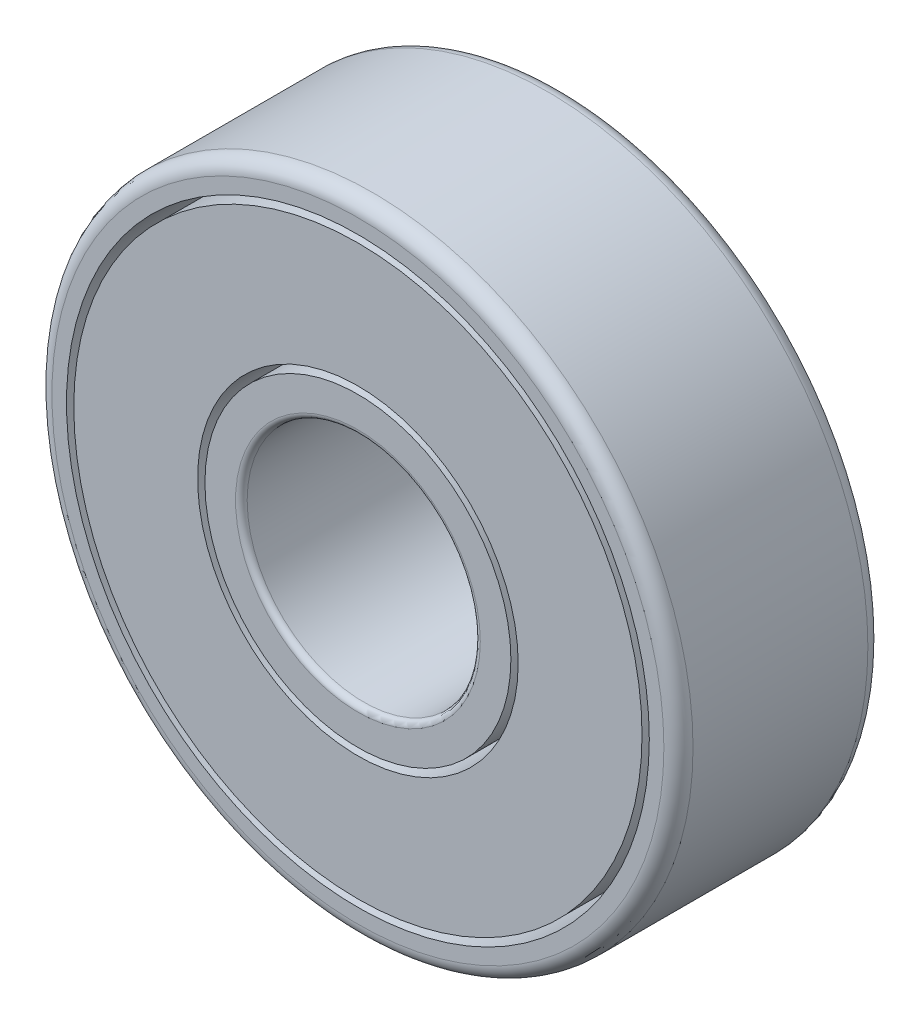
ISO-10303-21;
HEADER;
FILE_DESCRIPTION(('STEP AP214'),'2;1');
FILE_NAME('part.step','',(''),(''),'','','');
FILE_SCHEMA(('AUTOMOTIVE_DESIGN { 1 0 10303 214 1 1 1 1 }'));
ENDSEC;
DATA;
#1=APPLICATION_CONTEXT('core data for automotive mechanical design processes');
#2=APPLICATION_PROTOCOL_DEFINITION('international standard','automotive_design',2000,#1);
#3=PRODUCT_CONTEXT('',#1,'mechanical');
#4=PRODUCT('Part','Part','',(#3));
#5=PRODUCT_RELATED_PRODUCT_CATEGORY('part','',(#4));
#6=PRODUCT_DEFINITION_FORMATION('','',#4);
#7=PRODUCT_DEFINITION_CONTEXT('part definition',#1,'design');
#8=PRODUCT_DEFINITION('design','',#6,#7);
#9=PRODUCT_DEFINITION_SHAPE('','',#8);
#10=(LENGTH_UNIT() NAMED_UNIT(*) SI_UNIT(.MILLI.,.METRE.));
#11=(NAMED_UNIT(*) PLANE_ANGLE_UNIT() SI_UNIT($,.RADIAN.));
#12=(NAMED_UNIT(*) SI_UNIT($,.STERADIAN.) SOLID_ANGLE_UNIT());
#13=UNCERTAINTY_MEASURE_WITH_UNIT(LENGTH_MEASURE(1.E-05),#10,'distance_accuracy_value','');
#14=(GEOMETRIC_REPRESENTATION_CONTEXT(3) GLOBAL_UNCERTAINTY_ASSIGNED_CONTEXT((#13)) GLOBAL_UNIT_ASSIGNED_CONTEXT((#10,
#11,#12)) REPRESENTATION_CONTEXT('',''));
#15=CARTESIAN_POINT('',(0.,0.,0.));
#16=DIRECTION('',(0.,0.,1.));
#17=DIRECTION('',(1.,0.,0.));
#18=AXIS2_PLACEMENT_3D('',#15,#16,#17);
#19=CARTESIAN_POINT('',(0.,0.,7.));
#20=DIRECTION('',(0.,0.,-1.));
#21=DIRECTION('',(-1.,0.,0.));
#22=AXIS2_PLACEMENT_3D('',#19,#20,#21);
#23=CYLINDRICAL_SURFACE('',#22,10.);
#24=CARTESIAN_POINT('',(0.,0.,7.));
#25=DIRECTION('',(0.,0.,1.));
#26=DIRECTION('',(1.,0.,0.));
#27=AXIS2_PLACEMENT_3D('',#24,#25,#26);
#28=CIRCLE('',#27,10.);
#29=CARTESIAN_POINT('',(10.,0.,7.));
#30=VERTEX_POINT('',#29);
#31=EDGE_CURVE('E98',#30,#30,#28,.T.);
#32=ORIENTED_EDGE('',*,*,#31,.T.);
#33=EDGE_LOOP('',(#32));
#34=FACE_BOUND('',#33,.T.);
#35=CARTESIAN_POINT('',(0.,0.,0.));
#36=DIRECTION('',(0.,0.,1.));
#37=DIRECTION('',(1.,0.,0.));
#38=AXIS2_PLACEMENT_3D('',#35,#36,#37);
#39=CIRCLE('',#38,10.);
#40=CARTESIAN_POINT('',(10.,0.,0.));
#41=VERTEX_POINT('',#40);
#42=EDGE_CURVE('E99',#41,#41,#39,.T.);
#43=ORIENTED_EDGE('',*,*,#42,.F.);
#44=EDGE_LOOP('',(#43));
#45=FACE_BOUND('',#44,.T.);
#46=ADVANCED_FACE('F78',(#34,#45),#23,.F.);
#47=CARTESIAN_POINT('',(0.,0.,7.));
#48=DIRECTION('',(0.,0.,-1.));
#49=DIRECTION('',(-1.,0.,0.));
#50=AXIS2_PLACEMENT_3D('',#47,#48,#49);
#51=CYLINDRICAL_SURFACE('',#50,11.);
#52=CARTESIAN_POINT('',(0.,0.,0.5));
#53=DIRECTION('',(0.,0.,1.));
#54=DIRECTION('',(1.,0.,0.));
#55=AXIS2_PLACEMENT_3D('',#52,#53,#54);
#56=CIRCLE('',#55,11.);
#57=CARTESIAN_POINT('',(11.,0.,0.5));
#58=VERTEX_POINT('',#57);
#59=EDGE_CURVE('E89',#58,#58,#56,.T.);
#60=ORIENTED_EDGE('',*,*,#59,.T.);
#61=EDGE_LOOP('',(#60));
#62=FACE_BOUND('',#61,.T.);
#63=CARTESIAN_POINT('',(0.,0.,6.5));
#64=DIRECTION('',(0.,0.,1.));
#65=DIRECTION('',(1.,0.,0.));
#66=AXIS2_PLACEMENT_3D('',#63,#64,#65);
#67=CIRCLE('',#66,11.);
#68=CARTESIAN_POINT('',(11.,0.,6.5));
#69=VERTEX_POINT('',#68);
#70=EDGE_CURVE('E93',#69,#69,#67,.F.);
#71=ORIENTED_EDGE('',*,*,#70,.T.);
#72=EDGE_LOOP('',(#71));
#73=FACE_BOUND('',#72,.T.);
#74=ADVANCED_FACE('F110',(#62,#73),#51,.T.);
#75=CARTESIAN_POINT('',(0.,0.,7.));
#76=DIRECTION('',(0.,0.,1.));
#77=DIRECTION('',(1.,0.,0.));
#78=AXIS2_PLACEMENT_3D('',#75,#76,#77);
#79=PLANE('',#78);
#80=CARTESIAN_POINT('',(0.,0.,7.));
#81=DIRECTION('',(0.,0.,1.));
#82=DIRECTION('',(1.,0.,0.));
#83=AXIS2_PLACEMENT_3D('',#80,#81,#82);
#84=CIRCLE('',#83,10.5);
#85=CARTESIAN_POINT('',(10.5,0.,7.));
#86=VERTEX_POINT('',#85);
#87=EDGE_CURVE('E12',#86,#86,#84,.T.);
#88=ORIENTED_EDGE('',*,*,#87,.T.);
#89=EDGE_LOOP('',(#88));
#90=FACE_BOUND('',#89,.T.);
#91=ORIENTED_EDGE('',*,*,#31,.F.);
#92=EDGE_LOOP('',(#91));
#93=FACE_BOUND('',#92,.T.);
#94=ADVANCED_FACE('F107',(#90,#93),#79,.T.);
#95=CARTESIAN_POINT('',(0.,0.,0.));
#96=DIRECTION('',(0.,0.,1.));
#97=DIRECTION('',(1.,0.,0.));
#98=AXIS2_PLACEMENT_3D('',#95,#96,#97);
#99=PLANE('',#98);
#100=CARTESIAN_POINT('',(0.,0.,0.));
#101=DIRECTION('',(0.,0.,1.));
#102=DIRECTION('',(1.,0.,0.));
#103=AXIS2_PLACEMENT_3D('',#100,#101,#102);
#104=CIRCLE('',#103,10.5);
#105=CARTESIAN_POINT('',(10.5,0.,0.));
#106=VERTEX_POINT('',#105);
#107=EDGE_CURVE('E85',#106,#106,#104,.F.);
#108=ORIENTED_EDGE('',*,*,#107,.T.);
#109=EDGE_LOOP('',(#108));
#110=FACE_BOUND('',#109,.T.);
#111=ORIENTED_EDGE('',*,*,#42,.T.);
#112=EDGE_LOOP('',(#111));
#113=FACE_BOUND('',#112,.T.);
#114=ADVANCED_FACE('F109',(#110,#113),#99,.F.);
#115=CARTESIAN_POINT('',(0.,0.,0.5));
#116=DIRECTION('',(0.,0.,1.));
#117=DIRECTION('',(1.,0.,0.));
#118=AXIS2_PLACEMENT_3D('',#115,#116,#117);
#119=TOROIDAL_SURFACE('',#118,10.5,0.5);
#120=ORIENTED_EDGE('',*,*,#107,.F.);
#121=EDGE_LOOP('',(#120));
#122=FACE_BOUND('',#121,.T.);
#123=ORIENTED_EDGE('',*,*,#59,.F.);
#124=EDGE_LOOP('',(#123));
#125=FACE_BOUND('',#124,.T.);
#126=ADVANCED_FACE('F116',(#122,#125),#119,.T.);
#127=CARTESIAN_POINT('',(0.,0.,6.5));
#128=DIRECTION('',(0.,0.,1.));
#129=DIRECTION('',(1.,0.,0.));
#130=AXIS2_PLACEMENT_3D('',#127,#128,#129);
#131=TOROIDAL_SURFACE('',#130,10.5,0.5);
#132=ORIENTED_EDGE('',*,*,#70,.F.);
#133=EDGE_LOOP('',(#132));
#134=FACE_BOUND('',#133,.T.);
#135=ORIENTED_EDGE('',*,*,#87,.F.);
#136=EDGE_LOOP('',(#135));
#137=FACE_BOUND('',#136,.T.);
#138=ADVANCED_FACE('F80',(#134,#137),#131,.T.);
#139=CLOSED_SHELL('',(#46,#74,#94,#114,#126,#138));
#140=MANIFOLD_SOLID_BREP('B2',#139);
#141=CARTESIAN_POINT('',(0.,0.,7.));
#142=DIRECTION('',(0.,0.,-1.));
#143=DIRECTION('',(-1.,0.,0.));
#144=AXIS2_PLACEMENT_3D('',#141,#142,#143);
#145=CYLINDRICAL_SURFACE('',#144,4.);
#146=CARTESIAN_POINT('',(0.,0.,0.2));
#147=DIRECTION('',(0.,0.,1.));
#148=DIRECTION('',(1.,0.,0.));
#149=AXIS2_PLACEMENT_3D('',#146,#147,#148);
#150=CIRCLE('',#149,4.);
#151=CARTESIAN_POINT('',(4.,0.,0.2));
#152=VERTEX_POINT('',#151);
#153=EDGE_CURVE('E184',#152,#152,#150,.F.);
#154=ORIENTED_EDGE('',*,*,#153,.T.);
#155=EDGE_LOOP('',(#154));
#156=FACE_BOUND('',#155,.T.);
#157=CARTESIAN_POINT('',(0.,0.,6.8));
#158=DIRECTION('',(0.,0.,1.));
#159=DIRECTION('',(1.,0.,0.));
#160=AXIS2_PLACEMENT_3D('',#157,#158,#159);
#161=CIRCLE('',#160,4.);
#162=CARTESIAN_POINT('',(4.,0.,6.8));
#163=VERTEX_POINT('',#162);
#164=EDGE_CURVE('E188',#163,#163,#161,.T.);
#165=ORIENTED_EDGE('',*,*,#164,.T.);
#166=EDGE_LOOP('',(#165));
#167=FACE_BOUND('',#166,.T.);
#168=ADVANCED_FACE('F177',(#156,#167),#145,.F.);
#169=CARTESIAN_POINT('',(0.,0.,7.));
#170=DIRECTION('',(0.,0.,-1.));
#171=DIRECTION('',(-1.,0.,0.));
#172=AXIS2_PLACEMENT_3D('',#169,#170,#171);
#173=CYLINDRICAL_SURFACE('',#172,5.25);
#174=CARTESIAN_POINT('',(0.,0.,7.));
#175=DIRECTION('',(0.,0.,1.));
#176=DIRECTION('',(1.,0.,0.));
#177=AXIS2_PLACEMENT_3D('',#174,#175,#176);
#178=CIRCLE('',#177,5.25);
#179=CARTESIAN_POINT('',(5.25,0.,7.));
#180=VERTEX_POINT('',#179);
#181=EDGE_CURVE('E197',#180,#180,#178,.T.);
#182=ORIENTED_EDGE('',*,*,#181,.F.);
#183=EDGE_LOOP('',(#182));
#184=FACE_BOUND('',#183,.T.);
#185=CARTESIAN_POINT('',(0.,0.,0.));
#186=DIRECTION('',(0.,0.,1.));
#187=DIRECTION('',(1.,0.,0.));
#188=AXIS2_PLACEMENT_3D('',#185,#186,#187);
#189=CIRCLE('',#188,5.25);
#190=CARTESIAN_POINT('',(5.25,0.,0.));
#191=VERTEX_POINT('',#190);
#192=EDGE_CURVE('E198',#191,#191,#189,.T.);
#193=ORIENTED_EDGE('',*,*,#192,.T.);
#194=EDGE_LOOP('',(#193));
#195=FACE_BOUND('',#194,.T.);
#196=ADVANCED_FACE('F206',(#184,#195),#173,.T.);
#197=CARTESIAN_POINT('',(0.,0.,7.));
#198=DIRECTION('',(0.,0.,1.));
#199=DIRECTION('',(1.,0.,0.));
#200=AXIS2_PLACEMENT_3D('',#197,#198,#199);
#201=PLANE('',#200);
#202=CARTESIAN_POINT('',(0.,0.,7.));
#203=DIRECTION('',(0.,0.,1.));
#204=DIRECTION('',(1.,0.,0.));
#205=AXIS2_PLACEMENT_3D('',#202,#203,#204);
#206=CIRCLE('',#205,4.2);
#207=CARTESIAN_POINT('',(4.2,0.,7.));
#208=VERTEX_POINT('',#207);
#209=EDGE_CURVE('E77',#208,#208,#206,.F.);
#210=ORIENTED_EDGE('',*,*,#209,.T.);
#211=EDGE_LOOP('',(#210));
#212=FACE_BOUND('',#211,.T.);
#213=ORIENTED_EDGE('',*,*,#181,.T.);
#214=EDGE_LOOP('',(#213));
#215=FACE_BOUND('',#214,.T.);
#216=ADVANCED_FACE('F204',(#212,#215),#201,.T.);
#217=CARTESIAN_POINT('',(0.,0.,0.));
#218=DIRECTION('',(0.,0.,1.));
#219=DIRECTION('',(1.,0.,0.));
#220=AXIS2_PLACEMENT_3D('',#217,#218,#219);
#221=PLANE('',#220);
#222=CARTESIAN_POINT('',(0.,0.,0.));
#223=DIRECTION('',(0.,0.,1.));
#224=DIRECTION('',(1.,0.,0.));
#225=AXIS2_PLACEMENT_3D('',#222,#223,#224);
#226=CIRCLE('',#225,4.2);
#227=CARTESIAN_POINT('',(4.2,0.,0.));
#228=VERTEX_POINT('',#227);
#229=EDGE_CURVE('E192',#228,#228,#226,.T.);
#230=ORIENTED_EDGE('',*,*,#229,.T.);
#231=EDGE_LOOP('',(#230));
#232=FACE_BOUND('',#231,.T.);
#233=ORIENTED_EDGE('',*,*,#192,.F.);
#234=EDGE_LOOP('',(#233));
#235=FACE_BOUND('',#234,.T.);
#236=ADVANCED_FACE('F212',(#232,#235),#221,.F.);
#237=CARTESIAN_POINT('',(0.,0.,0.2));
#238=DIRECTION('',(0.,0.,1.));
#239=DIRECTION('',(1.,0.,0.));
#240=AXIS2_PLACEMENT_3D('',#237,#238,#239);
#241=TOROIDAL_SURFACE('',#240,4.2,0.2);
#242=ORIENTED_EDGE('',*,*,#153,.F.);
#243=EDGE_LOOP('',(#242));
#244=FACE_BOUND('',#243,.T.);
#245=ORIENTED_EDGE('',*,*,#229,.F.);
#246=EDGE_LOOP('',(#245));
#247=FACE_BOUND('',#246,.T.);
#248=ADVANCED_FACE('F214',(#244,#247),#241,.T.);
#249=CARTESIAN_POINT('',(0.,0.,6.8));
#250=DIRECTION('',(0.,0.,1.));
#251=DIRECTION('',(1.,0.,0.));
#252=AXIS2_PLACEMENT_3D('',#249,#250,#251);
#253=TOROIDAL_SURFACE('',#252,4.2,0.2);
#254=ORIENTED_EDGE('',*,*,#209,.F.);
#255=EDGE_LOOP('',(#254));
#256=FACE_BOUND('',#255,.T.);
#257=ORIENTED_EDGE('',*,*,#164,.F.);
#258=EDGE_LOOP('',(#257));
#259=FACE_BOUND('',#258,.T.);
#260=ADVANCED_FACE('F179',(#256,#259),#253,.T.);
#261=CLOSED_SHELL('',(#168,#196,#216,#236,#248,#260));
#262=MANIFOLD_SOLID_BREP('B7',#261);
#263=CARTESIAN_POINT('',(0.,0.,7.));
#264=DIRECTION('',(0.,0.,-1.));
#265=DIRECTION('',(-1.,0.,0.));
#266=AXIS2_PLACEMENT_3D('',#263,#264,#265);
#267=CYLINDRICAL_SURFACE('',#266,5.5);
#268=CARTESIAN_POINT('',(0.,0.,7.));
#269=DIRECTION('',(0.,0.,1.));
#270=DIRECTION('',(1.,0.,0.));
#271=AXIS2_PLACEMENT_3D('',#268,#269,#270);
#272=CIRCLE('',#271,5.5);
#273=CARTESIAN_POINT('',(5.5,0.,7.));
#274=VERTEX_POINT('',#273);
#275=EDGE_CURVE('E277',#274,#274,#272,.T.);
#276=ORIENTED_EDGE('',*,*,#275,.T.);
#277=EDGE_LOOP('',(#276));
#278=FACE_BOUND('',#277,.T.);
#279=CARTESIAN_POINT('',(0.,0.,0.));
#280=DIRECTION('',(0.,0.,1.));
#281=DIRECTION('',(1.,0.,0.));
#282=AXIS2_PLACEMENT_3D('',#279,#280,#281);
#283=CIRCLE('',#282,5.5);
#284=CARTESIAN_POINT('',(5.5,0.,0.));
#285=VERTEX_POINT('',#284);
#286=EDGE_CURVE('E284',#285,#285,#283,.T.);
#287=ORIENTED_EDGE('',*,*,#286,.F.);
#288=EDGE_LOOP('',(#287));
#289=FACE_BOUND('',#288,.T.);
#290=ADVANCED_FACE('F269',(#278,#289),#267,.F.);
#291=CARTESIAN_POINT('',(0.,0.,7.));
#292=DIRECTION('',(0.,0.,-1.));
#293=DIRECTION('',(-1.,0.,0.));
#294=AXIS2_PLACEMENT_3D('',#291,#292,#293);
#295=CYLINDRICAL_SURFACE('',#294,9.75);
#296=CARTESIAN_POINT('',(0.,0.,7.));
#297=DIRECTION('',(0.,0.,1.));
#298=DIRECTION('',(1.,0.,0.));
#299=AXIS2_PLACEMENT_3D('',#296,#297,#298);
#300=CIRCLE('',#299,9.75);
#301=CARTESIAN_POINT('',(9.75,0.,7.));
#302=VERTEX_POINT('',#301);
#303=EDGE_CURVE('E176',#302,#302,#300,.T.);
#304=ORIENTED_EDGE('',*,*,#303,.F.);
#305=EDGE_LOOP('',(#304));
#306=FACE_BOUND('',#305,.T.);
#307=CARTESIAN_POINT('',(0.,0.,0.));
#308=DIRECTION('',(0.,0.,1.));
#309=DIRECTION('',(1.,0.,0.));
#310=AXIS2_PLACEMENT_3D('',#307,#308,#309);
#311=CIRCLE('',#310,9.75);
#312=CARTESIAN_POINT('',(9.75,0.,0.));
#313=VERTEX_POINT('',#312);
#314=EDGE_CURVE('E272',#313,#313,#311,.T.);
#315=ORIENTED_EDGE('',*,*,#314,.T.);
#316=EDGE_LOOP('',(#315));
#317=FACE_BOUND('',#316,.T.);
#318=ADVANCED_FACE('F293',(#306,#317),#295,.T.);
#319=CARTESIAN_POINT('',(0.,0.,7.));
#320=DIRECTION('',(0.,0.,1.));
#321=DIRECTION('',(1.,0.,0.));
#322=AXIS2_PLACEMENT_3D('',#319,#320,#321);
#323=PLANE('',#322);
#324=ORIENTED_EDGE('',*,*,#275,.F.);
#325=EDGE_LOOP('',(#324));
#326=FACE_BOUND('',#325,.T.);
#327=ORIENTED_EDGE('',*,*,#303,.T.);
#328=EDGE_LOOP('',(#327));
#329=FACE_BOUND('',#328,.T.);
#330=ADVANCED_FACE('F297',(#326,#329),#323,.T.);
#331=CARTESIAN_POINT('',(0.,0.,0.));
#332=DIRECTION('',(0.,0.,1.));
#333=DIRECTION('',(1.,0.,0.));
#334=AXIS2_PLACEMENT_3D('',#331,#332,#333);
#335=PLANE('',#334);
#336=ORIENTED_EDGE('',*,*,#286,.T.);
#337=EDGE_LOOP('',(#336));
#338=FACE_BOUND('',#337,.T.);
#339=ORIENTED_EDGE('',*,*,#314,.F.);
#340=EDGE_LOOP('',(#339));
#341=FACE_BOUND('',#340,.T.);
#342=ADVANCED_FACE('F295',(#338,#341),#335,.F.);
#343=CLOSED_SHELL('',(#290,#318,#330,#342));
#344=MANIFOLD_SOLID_BREP('B72',#343);
#345=ADVANCED_BREP_SHAPE_REPRESENTATION('',(#18,#140,#262,#344),#14);
#346=SHAPE_DEFINITION_REPRESENTATION(#9,#345);
ENDSEC;
END-ISO-10303-21;
